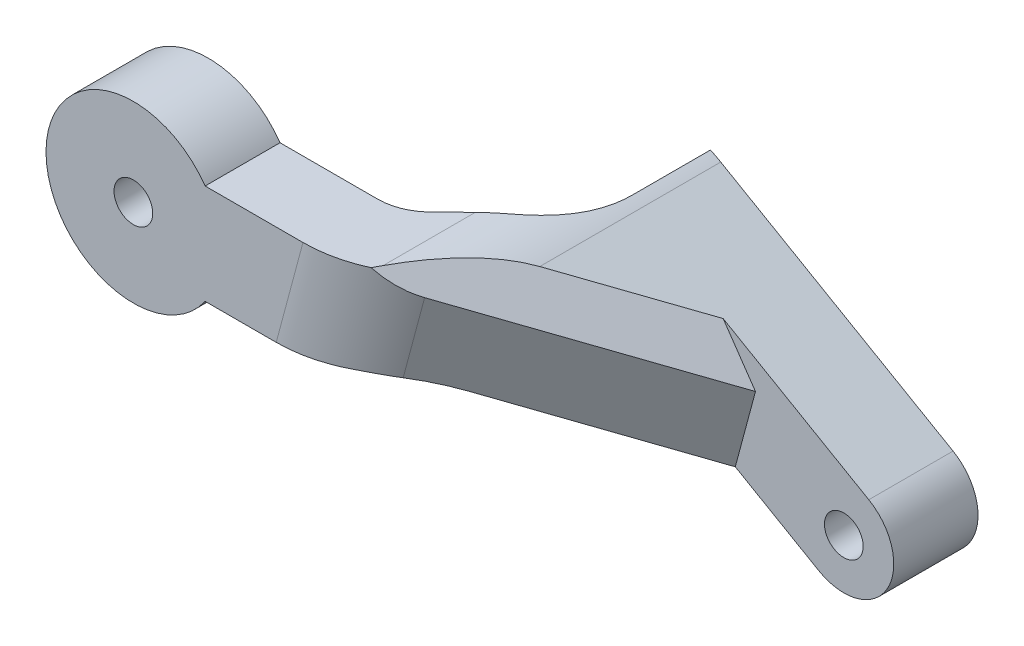
ISO-10303-21;
HEADER;
FILE_DESCRIPTION(('STEP AP214'),'2;1');
FILE_NAME('part.step','',(''),(''),'','','');
FILE_SCHEMA(('AUTOMOTIVE_DESIGN { 1 0 10303 214 1 1 1 1 }'));
ENDSEC;
DATA;
#1=APPLICATION_CONTEXT('core data for automotive mechanical design processes');
#2=APPLICATION_PROTOCOL_DEFINITION('international standard','automotive_design',2000,#1);
#3=PRODUCT_CONTEXT('',#1,'mechanical');
#4=PRODUCT('Part','Part','',(#3));
#5=PRODUCT_RELATED_PRODUCT_CATEGORY('part','',(#4));
#6=PRODUCT_DEFINITION_FORMATION('','',#4);
#7=PRODUCT_DEFINITION_CONTEXT('part definition',#1,'design');
#8=PRODUCT_DEFINITION('design','',#6,#7);
#9=PRODUCT_DEFINITION_SHAPE('','',#8);
#10=(LENGTH_UNIT() NAMED_UNIT(*) SI_UNIT(.MILLI.,.METRE.));
#11=(NAMED_UNIT(*) PLANE_ANGLE_UNIT() SI_UNIT($,.RADIAN.));
#12=(NAMED_UNIT(*) SI_UNIT($,.STERADIAN.) SOLID_ANGLE_UNIT());
#13=UNCERTAINTY_MEASURE_WITH_UNIT(LENGTH_MEASURE(1.E-05),#10,'distance_accuracy_value','');
#14=(GEOMETRIC_REPRESENTATION_CONTEXT(3) GLOBAL_UNCERTAINTY_ASSIGNED_CONTEXT((#13)) GLOBAL_UNIT_ASSIGNED_CONTEXT((#10,
#11,#12)) REPRESENTATION_CONTEXT('',''));
#15=CARTESIAN_POINT('',(0.,0.,0.));
#16=DIRECTION('',(0.,0.,1.));
#17=DIRECTION('',(1.,0.,0.));
#18=AXIS2_PLACEMENT_3D('',#15,#16,#17);
#19=CARTESIAN_POINT('',(0.,0.,-25.35));
#20=DIRECTION('',(0.,0.,-1.));
#21=DIRECTION('',(1.,0.,0.));
#22=AXIS2_PLACEMENT_3D('',#19,#20,#21);
#23=PLANE('',#22);
#24=CARTESIAN_POINT('',(40.,-11.5470053837925,-25.35));
#25=DIRECTION('',(0.,0.,-1.));
#26=DIRECTION('',(-1.,0.,0.));
#27=AXIS2_PLACEMENT_3D('',#24,#25,#26);
#28=CIRCLE('',#27,1.55);
#29=CARTESIAN_POINT('',(38.45,-11.5470053837925,-25.35));
#30=VERTEX_POINT('',#29);
#31=EDGE_CURVE('E601',#30,#30,#28,.T.);
#32=ORIENTED_EDGE('',*,*,#31,.F.);
#33=EDGE_LOOP('',(#32));
#34=FACE_BOUND('',#33,.T.);
#35=DIRECTION('',(-0.866025403784438,0.500000000000001,0.));
#36=VECTOR('',#35,1.);
#37=CARTESIAN_POINT('',(7.00000000000003,12.1243556529822,-25.35));
#38=LINE('',#37,#36);
#39=CARTESIAN_POINT('',(42.,-8.0829037686548,-25.35));
#40=VERTEX_POINT('',#39);
#41=CARTESIAN_POINT('',(23.3923048454133,2.66025403784438,-25.35));
#42=VERTEX_POINT('',#41);
#43=EDGE_CURVE('E169',#40,#42,#38,.T.);
#44=ORIENTED_EDGE('',*,*,#43,.F.);
#45=CARTESIAN_POINT('',(40.,-11.5470053837925,-25.35));
#46=DIRECTION('',(0.,0.,1.));
#47=DIRECTION('',(1.,0.,0.));
#48=AXIS2_PLACEMENT_3D('',#45,#46,#47);
#49=CIRCLE('',#48,4.);
#50=CARTESIAN_POINT('',(38.,-15.0111069989303,-25.35));
#51=VERTEX_POINT('',#50);
#52=EDGE_CURVE('E179',#40,#51,#49,.F.);
#53=ORIENTED_EDGE('',*,*,#52,.T.);
#54=DIRECTION('',(-0.866025403784438,0.500000000000001,0.));
#55=VECTOR('',#54,1.);
#56=CARTESIAN_POINT('',(3.00000000000002,5.19615242270665,-25.35));
#57=LINE('',#56,#55);
#58=CARTESIAN_POINT('',(21.2487113059643,-5.33974596215562,-25.35));
#59=VERTEX_POINT('',#58);
#60=EDGE_CURVE('E185',#51,#59,#57,.T.);
#61=ORIENTED_EDGE('',*,*,#60,.T.);
#62=CARTESIAN_POINT('',(16.2487113059643,-14.,-25.35));
#63=DIRECTION('',(0.,0.,1.));
#64=DIRECTION('',(1.,0.,0.));
#65=AXIS2_PLACEMENT_3D('',#62,#63,#64);
#66=CIRCLE('',#65,10.);
#67=CARTESIAN_POINT('',(20.4242386444629,-4.91347308123447,-25.35));
#68=VERTEX_POINT('',#67);
#69=EDGE_CURVE('E241',#68,#59,#66,.F.);
#70=ORIENTED_EDGE('',*,*,#69,.F.);
#71=DIRECTION('',(-0.258819045102521,-0.965925826289068,0.));
#72=VECTOR('',#71,1.);
#73=CARTESIAN_POINT('',(17.8819508450437,-14.4014203161296,-25.35));
#74=LINE('',#73,#72);
#75=CARTESIAN_POINT('',(22.5678321839119,3.08652691876553,-25.35));
#76=VERTEX_POINT('',#75);
#77=EDGE_CURVE('E191',#76,#68,#74,.T.);
#78=ORIENTED_EDGE('',*,*,#77,.F.);
#79=CARTESIAN_POINT('',(18.3923048454133,-6.,-25.35));
#80=DIRECTION('',(0.,0.,1.));
#81=DIRECTION('',(1.,0.,0.));
#82=AXIS2_PLACEMENT_3D('',#79,#80,#81);
#83=CIRCLE('',#82,10.);
#84=EDGE_CURVE('E190',#42,#76,#83,.T.);
#85=ORIENTED_EDGE('',*,*,#84,.F.);
#86=EDGE_LOOP('',(#44,#53,#61,#70,#78,#85));
#87=FACE_BOUND('',#86,.T.);
#88=ADVANCED_FACE('F45',(#34,#87),#23,.T.);
#89=CARTESIAN_POINT('',(40.,-11.5470053837925,-1.69999999999997));
#90=DIRECTION('',(0.,0.,-1.));
#91=DIRECTION('',(1.,0.,0.));
#92=AXIS2_PLACEMENT_3D('',#89,#90,#91);
#93=CYLINDRICAL_SURFACE('',#92,4.);
#94=DIRECTION('',(0.,0.,-1.));
#95=VECTOR('',#94,1.);
#96=CARTESIAN_POINT('',(42.,-8.0829037686548,-1.69999999999997));
#97=LINE('',#96,#95);
#98=CARTESIAN_POINT('',(42.,-8.0829037686548,-18.6));
#99=VERTEX_POINT('',#98);
#100=EDGE_CURVE('E163',#99,#40,#97,.T.);
#101=ORIENTED_EDGE('',*,*,#100,.F.);
#102=CARTESIAN_POINT('',(40.,-11.5470053837925,-18.6));
#103=DIRECTION('',(0.,0.,1.));
#104=DIRECTION('',(1.,0.,0.));
#105=AXIS2_PLACEMENT_3D('',#102,#103,#104);
#106=CIRCLE('',#105,4.);
#107=CARTESIAN_POINT('',(38.,-15.0111069989303,-18.6));
#108=VERTEX_POINT('',#107);
#109=EDGE_CURVE('E201',#99,#108,#106,.F.);
#110=ORIENTED_EDGE('',*,*,#109,.T.);
#111=DIRECTION('',(0.,0.,-1.));
#112=VECTOR('',#111,1.);
#113=CARTESIAN_POINT('',(38.,-15.0111069989303,-1.69999999999997));
#114=LINE('',#113,#112);
#115=EDGE_CURVE('E175',#108,#51,#114,.T.);
#116=ORIENTED_EDGE('',*,*,#115,.T.);
#117=ORIENTED_EDGE('',*,*,#52,.F.);
#118=EDGE_LOOP('',(#101,#110,#116,#117));
#119=FACE_BOUND('',#118,.T.);
#120=ADVANCED_FACE('F180',(#119),#93,.T.);
#121=CARTESIAN_POINT('',(7.00000000000003,12.1243556529822,-1.69999999999997));
#122=DIRECTION('',(-0.500000000000001,-0.866025403784438,0.));
#123=DIRECTION('',(0.866025403784438,-0.500000000000001,0.));
#124=AXIS2_PLACEMENT_3D('',#121,#122,#123);
#125=PLANE('',#124);
#126=DIRECTION('',(-0.622892752510496,0.359627298338203,0.694746590606866));
#127=VECTOR('',#126,1.);
#128=CARTESIAN_POINT('',(10.9496274143465,9.84403720211049,3.02151875187413));
#129=LINE('',#128,#127);
#130=CARTESIAN_POINT('',(30.3349507982985,-1.34808447194216,-18.6));
#131=VERTEX_POINT('',#130);
#132=CARTESIAN_POINT('',(23.3923048454133,2.66025403784438,-10.8564846257763));
#133=VERTEX_POINT('',#132);
#134=EDGE_CURVE('E206',#131,#133,#129,.T.);
#135=ORIENTED_EDGE('',*,*,#134,.F.);
#136=DIRECTION('',(-0.866025403784438,0.500000000000001,0.));
#137=VECTOR('',#136,1.);
#138=CARTESIAN_POINT('',(7.00000000000003,12.1243556529821,-18.6));
#139=LINE('',#138,#137);
#140=EDGE_CURVE('E171',#99,#131,#139,.T.);
#141=ORIENTED_EDGE('',*,*,#140,.F.);
#142=ORIENTED_EDGE('',*,*,#100,.T.);
#143=ORIENTED_EDGE('',*,*,#43,.T.);
#144=DIRECTION('',(0.,0.,-1.));
#145=VECTOR('',#144,1.);
#146=CARTESIAN_POINT('',(23.3923048454133,2.66025403784438,-1.69999999999997));
#147=LINE('',#146,#145);
#148=EDGE_CURVE('E223',#133,#42,#147,.T.);
#149=ORIENTED_EDGE('',*,*,#148,.F.);
#150=EDGE_LOOP('',(#135,#141,#142,#143,#149));
#151=FACE_BOUND('',#150,.T.);
#152=ADVANCED_FACE('F166',(#151),#125,.F.);
#153=CARTESIAN_POINT('',(3.00000000000002,5.19615242270665,-1.69999999999997));
#154=DIRECTION('',(-0.500000000000001,-0.866025403784438,0.));
#155=DIRECTION('',(0.866025403784438,-0.500000000000001,0.));
#156=AXIS2_PLACEMENT_3D('',#153,#154,#155);
#157=PLANE('',#156);
#158=ORIENTED_EDGE('',*,*,#60,.F.);
#159=ORIENTED_EDGE('',*,*,#115,.F.);
#160=DIRECTION('',(-0.866025403784438,0.500000000000001,0.));
#161=VECTOR('',#160,1.);
#162=CARTESIAN_POINT('',(3.00000000000002,5.19615242270664,-18.6));
#163=LINE('',#162,#161);
#164=CARTESIAN_POINT('',(31.3073117168471,-11.1470816170497,-18.6));
#165=VERTEX_POINT('',#164);
#166=EDGE_CURVE('E305',#108,#165,#163,.T.);
#167=ORIENTED_EDGE('',*,*,#166,.T.);
#168=DIRECTION('',(-0.622892752510496,0.359627298338203,0.694746590606866));
#169=VECTOR('',#168,1.);
#170=CARTESIAN_POINT('',(9.34965090661684,1.53017976251126,5.89058834626975));
#171=LINE('',#170,#169);
#172=CARTESIAN_POINT('',(21.2487113059643,-5.33974596215562,-7.38108901801699));
#173=VERTEX_POINT('',#172);
#174=EDGE_CURVE('E316',#165,#173,#171,.T.);
#175=ORIENTED_EDGE('',*,*,#174,.T.);
#176=DIRECTION('',(0.,0.,-1.));
#177=VECTOR('',#176,1.);
#178=CARTESIAN_POINT('',(21.2487113059643,-5.33974596215562,-4.79289856699177));
#179=LINE('',#178,#177);
#180=EDGE_CURVE('E220',#59,#173,#179,.F.);
#181=ORIENTED_EDGE('',*,*,#180,.F.);
#182=EDGE_LOOP('',(#158,#159,#167,#175,#181));
#183=FACE_BOUND('',#182,.T.);
#184=ADVANCED_FACE('F383',(#183),#157,.T.);
#185=CARTESIAN_POINT('',(17.8819508450437,-14.4014203161296,-14.959663415449));
#186=DIRECTION('',(0.965925826289068,-0.258819045102521,0.));
#187=DIRECTION('',(0.258819045102521,0.965925826289068,0.));
#188=AXIS2_PLACEMENT_3D('',#185,#186,#187);
#189=PLANE('',#188);
#190=DIRECTION('',(0.,0.,-1.));
#191=VECTOR('',#190,1.);
#192=CARTESIAN_POINT('',(22.5678321839119,3.08652691876553,-25.35));
#193=LINE('',#192,#191);
#194=CARTESIAN_POINT('',(22.5678321839119,3.08652691876553,-19.1017990391799));
#195=VERTEX_POINT('',#194);
#196=EDGE_CURVE('E226',#76,#195,#193,.F.);
#197=ORIENTED_EDGE('',*,*,#196,.F.);
#198=ORIENTED_EDGE('',*,*,#77,.T.);
#199=DIRECTION('',(0.,0.,1.));
#200=VECTOR('',#199,1.);
#201=CARTESIAN_POINT('',(20.4242386444629,-4.91347308123447,-14.959663415449));
#202=LINE('',#201,#200);
#203=CARTESIAN_POINT('',(20.4242386444629,-4.91347308123447,-19.1017990391799));
#204=VERTEX_POINT('',#203);
#205=EDGE_CURVE('E239',#204,#68,#202,.F.);
#206=ORIENTED_EDGE('',*,*,#205,.F.);
#207=DIRECTION('',(0.258819045102521,0.965925826289068,0.));
#208=VECTOR('',#207,1.);
#209=CARTESIAN_POINT('',(20.4242386444629,-4.91347308123447,-19.1017990391799));
#210=LINE('',#209,#208);
#211=EDGE_CURVE('E366',#195,#204,#210,.F.);
#212=ORIENTED_EDGE('',*,*,#211,.F.);
#213=EDGE_LOOP('',(#197,#198,#206,#212));
#214=FACE_BOUND('',#213,.T.);
#215=ADVANCED_FACE('F379',(#214),#189,.F.);
#216=CARTESIAN_POINT('',(0.,0.,-1.69999999999997));
#217=DIRECTION('',(0.,0.,-1.));
#218=DIRECTION('',(1.,0.,0.));
#219=AXIS2_PLACEMENT_3D('',#216,#217,#218);
#220=PLANE('',#219);
#221=DIRECTION('',(1.,0.,0.));
#222=VECTOR('',#221,1.);
#223=CARTESIAN_POINT('',(0.,4.,-1.69999999999997));
#224=LINE('',#223,#222);
#225=CARTESIAN_POINT('',(5.74456264653803,4.,-1.69999999999997));
#226=VERTEX_POINT('',#225);
#227=CARTESIAN_POINT('',(13.5815382076167,4.,-1.69999999999997));
#228=VERTEX_POINT('',#227);
#229=EDGE_CURVE('E333',#226,#228,#224,.T.);
#230=ORIENTED_EDGE('',*,*,#229,.F.);
#231=CARTESIAN_POINT('',(0.,0.,-1.69999999999997));
#232=DIRECTION('',(0.,0.,1.));
#233=DIRECTION('',(1.,0.,0.));
#234=AXIS2_PLACEMENT_3D('',#231,#232,#233);
#235=CIRCLE('',#234,7.);
#236=CARTESIAN_POINT('',(5.74456264653803,-4.,-1.69999999999997));
#237=VERTEX_POINT('',#236);
#238=EDGE_CURVE('E330',#226,#237,#235,.T.);
#239=ORIENTED_EDGE('',*,*,#238,.T.);
#240=DIRECTION('',(1.,0.,0.));
#241=VECTOR('',#240,1.);
#242=CARTESIAN_POINT('',(0.,-4.,-1.69999999999997));
#243=LINE('',#242,#241);
#244=CARTESIAN_POINT('',(11.4379446681677,-4.,-1.69999999999997));
#245=VERTEX_POINT('',#244);
#246=EDGE_CURVE('E205',#237,#245,#243,.T.);
#247=ORIENTED_EDGE('',*,*,#246,.T.);
#248=DIRECTION('',(-0.258819045102521,-0.965925826289068,0.));
#249=VECTOR('',#248,1.);
#250=CARTESIAN_POINT('',(11.6717476589409,-3.12743535947305,-1.69999999999997));
#251=LINE('',#250,#249);
#252=EDGE_CURVE('E247',#228,#245,#251,.T.);
#253=ORIENTED_EDGE('',*,*,#252,.F.);
#254=EDGE_LOOP('',(#230,#239,#247,#253));
#255=FACE_BOUND('',#254,.T.);
#256=CARTESIAN_POINT('',(0.,0.,-1.69999999999997));
#257=DIRECTION('',(0.,0.,-1.));
#258=DIRECTION('',(-1.,0.,0.));
#259=AXIS2_PLACEMENT_3D('',#256,#257,#258);
#260=CIRCLE('',#259,1.55);
#261=CARTESIAN_POINT('',(-1.55,0.,-1.69999999999997));
#262=VERTEX_POINT('',#261);
#263=EDGE_CURVE('E194',#262,#262,#260,.F.);
#264=ORIENTED_EDGE('',*,*,#263,.F.);
#265=EDGE_LOOP('',(#264));
#266=FACE_BOUND('',#265,.T.);
#267=ADVANCED_FACE('F352',(#255,#266),#220,.F.);
#268=CARTESIAN_POINT('',(0.,4.,-1.69999999999997));
#269=DIRECTION('',(0.,-1.,0.));
#270=DIRECTION('',(0.,0.,1.));
#271=AXIS2_PLACEMENT_3D('',#268,#269,#270);
#272=PLANE('',#271);
#273=DIRECTION('',(0.475576474947912,0.,-0.879674380936559));
#274=VECTOR('',#273,1.);
#275=CARTESIAN_POINT('',(14.0593147284774,4.,4.70270233877149));
#276=LINE('',#275,#274);
#277=CARTESIAN_POINT('',(18.3923048454133,4.,-3.31203472141891));
#278=VERTEX_POINT('',#277);
#279=CARTESIAN_POINT('',(18.0504129407587,4.,-2.67963685184986));
#280=VERTEX_POINT('',#279);
#281=EDGE_CURVE('E209',#278,#280,#276,.F.);
#282=ORIENTED_EDGE('',*,*,#281,.F.);
#283=DIRECTION('',(0.,0.,-1.));
#284=VECTOR('',#283,1.);
#285=CARTESIAN_POINT('',(18.3923048454133,4.,-1.69999999999997));
#286=LINE('',#285,#284);
#287=CARTESIAN_POINT('',(18.3923048454133,4.,-10.6899894902051));
#288=VERTEX_POINT('',#287);
#289=EDGE_CURVE('E231',#288,#278,#286,.F.);
#290=ORIENTED_EDGE('',*,*,#289,.F.);
#291=DIRECTION('',(0.719254596676404,0.,-0.694746590606865));
#292=VECTOR('',#291,1.);
#293=CARTESIAN_POINT('',(4.38517088009313,4.,2.83986295918837));
#294=LINE('',#293,#292);
#295=CARTESIAN_POINT('',(16.5097414378922,4.,-8.87157287525379));
#296=VERTEX_POINT('',#295);
#297=EDGE_CURVE('E301',#296,#288,#294,.T.);
#298=ORIENTED_EDGE('',*,*,#297,.F.);
#299=CARTESIAN_POINT('',(13.5815382076167,4.,-11.7));
#300=DIRECTION('',(0.,1.,0.));
#301=DIRECTION('',(-1.,0.,0.));
#302=AXIS2_PLACEMENT_3D('',#299,#300,#301);
#303=ELLIPSE('',#302,4.14110472164033,4.);
#304=CARTESIAN_POINT('',(13.5815382076167,4.,-7.69999999999998));
#305=VERTEX_POINT('',#304);
#306=EDGE_CURVE('E54',#305,#296,#303,.T.);
#307=ORIENTED_EDGE('',*,*,#306,.F.);
#308=DIRECTION('',(1.,0.,0.));
#309=VECTOR('',#308,1.);
#310=CARTESIAN_POINT('',(0.,4.,-7.69999999999998));
#311=LINE('',#310,#309);
#312=CARTESIAN_POINT('',(5.74456264653803,4.,-7.69999999999998));
#313=VERTEX_POINT('',#312);
#314=EDGE_CURVE('E320',#313,#305,#311,.T.);
#315=ORIENTED_EDGE('',*,*,#314,.F.);
#316=DIRECTION('',(0.,0.,-1.));
#317=VECTOR('',#316,1.);
#318=CARTESIAN_POINT('',(5.74456264653803,4.,-1.69999999999997));
#319=LINE('',#318,#317);
#320=EDGE_CURVE('E176',#226,#313,#319,.T.);
#321=ORIENTED_EDGE('',*,*,#320,.F.);
#322=ORIENTED_EDGE('',*,*,#229,.T.);
#323=CARTESIAN_POINT('',(13.5815382076167,4.,-11.7));
#324=DIRECTION('',(0.,1.,0.));
#325=DIRECTION('',(-1.,0.,0.));
#326=AXIS2_PLACEMENT_3D('',#323,#324,#325);
#327=ELLIPSE('',#326,10.3527618041008,10.);
#328=EDGE_CURVE('E355',#280,#228,#327,.F.);
#329=ORIENTED_EDGE('',*,*,#328,.F.);
#330=EDGE_LOOP('',(#282,#290,#298,#307,#315,#321,#322,#329));
#331=FACE_BOUND('',#330,.T.);
#332=ADVANCED_FACE('F303',(#331),#272,.F.);
#333=CARTESIAN_POINT('',(0.,0.,-1.69999999999997));
#334=DIRECTION('',(0.,0.,-1.));
#335=DIRECTION('',(1.,0.,0.));
#336=AXIS2_PLACEMENT_3D('',#333,#334,#335);
#337=CYLINDRICAL_SURFACE('',#336,7.);
#338=CARTESIAN_POINT('',(0.,0.,-7.69999999999998));
#339=DIRECTION('',(0.,0.,-1.));
#340=DIRECTION('',(-1.,0.,0.));
#341=AXIS2_PLACEMENT_3D('',#338,#339,#340);
#342=CIRCLE('',#341,7.);
#343=CARTESIAN_POINT('',(5.74456264653803,-4.,-7.69999999999998));
#344=VERTEX_POINT('',#343);
#345=EDGE_CURVE('E311',#313,#344,#342,.F.);
#346=ORIENTED_EDGE('',*,*,#345,.T.);
#347=DIRECTION('',(0.,0.,-1.));
#348=VECTOR('',#347,1.);
#349=CARTESIAN_POINT('',(5.74456264653803,-4.,-1.69999999999997));
#350=LINE('',#349,#348);
#351=EDGE_CURVE('E198',#237,#344,#350,.T.);
#352=ORIENTED_EDGE('',*,*,#351,.F.);
#353=ORIENTED_EDGE('',*,*,#238,.F.);
#354=ORIENTED_EDGE('',*,*,#320,.T.);
#355=EDGE_LOOP('',(#346,#352,#353,#354));
#356=FACE_BOUND('',#355,.T.);
#357=ADVANCED_FACE('F340',(#356),#337,.T.);
#358=CARTESIAN_POINT('',(0.,-4.,-1.69999999999997));
#359=DIRECTION('',(0.,-1.,0.));
#360=DIRECTION('',(1.,0.,0.));
#361=AXIS2_PLACEMENT_3D('',#358,#359,#360);
#362=PLANE('',#361);
#363=ORIENTED_EDGE('',*,*,#246,.F.);
#364=ORIENTED_EDGE('',*,*,#351,.T.);
#365=DIRECTION('',(1.,0.,0.));
#366=VECTOR('',#365,1.);
#367=CARTESIAN_POINT('',(0.,-4.,-7.69999999999998));
#368=LINE('',#367,#366);
#369=CARTESIAN_POINT('',(11.4379446681677,-4.,-7.69999999999998));
#370=VERTEX_POINT('',#369);
#371=EDGE_CURVE('E336',#344,#370,#368,.T.);
#372=ORIENTED_EDGE('',*,*,#371,.T.);
#373=CARTESIAN_POINT('',(11.4379446681677,-4.,-11.7));
#374=DIRECTION('',(0.,1.,0.));
#375=DIRECTION('',(-1.,0.,0.));
#376=AXIS2_PLACEMENT_3D('',#373,#374,#375);
#377=ELLIPSE('',#376,4.14110472164033,4.);
#378=CARTESIAN_POINT('',(14.3661478984432,-4.,-8.87157287525379));
#379=VERTEX_POINT('',#378);
#380=EDGE_CURVE('E11',#379,#370,#377,.F.);
#381=ORIENTED_EDGE('',*,*,#380,.F.);
#382=DIRECTION('',(0.719254596676404,0.,-0.694746590606865));
#383=VECTOR('',#382,1.);
#384=CARTESIAN_POINT('',(3.35051653041286,-4.,1.7687099560067));
#385=LINE('',#384,#383);
#386=CARTESIAN_POINT('',(16.2487113059643,-4.,-10.6899894902051));
#387=VERTEX_POINT('',#386);
#388=EDGE_CURVE('E306',#379,#387,#385,.T.);
#389=ORIENTED_EDGE('',*,*,#388,.T.);
#390=DIRECTION('',(0.,0.,-1.));
#391=VECTOR('',#390,1.);
#392=CARTESIAN_POINT('',(16.2487113059643,-4.,-13.2781799412303));
#393=LINE('',#392,#391);
#394=CARTESIAN_POINT('',(16.2487113059643,-4.,-2.84523612630837));
#395=VERTEX_POINT('',#394);
#396=EDGE_CURVE('E217',#395,#387,#393,.T.);
#397=ORIENTED_EDGE('',*,*,#396,.F.);
#398=CARTESIAN_POINT('',(11.4379446681677,-4.,-11.7));
#399=DIRECTION('',(0.,1.,0.));
#400=DIRECTION('',(-1.,0.,0.));
#401=AXIS2_PLACEMENT_3D('',#398,#399,#400);
#402=ELLIPSE('',#401,10.3527618041008,10.);
#403=EDGE_CURVE('E250',#245,#395,#402,.T.);
#404=ORIENTED_EDGE('',*,*,#403,.F.);
#405=EDGE_LOOP('',(#363,#364,#372,#381,#389,#397,#404));
#406=FACE_BOUND('',#405,.T.);
#407=ADVANCED_FACE('F347',(#406),#362,.T.);
#408=CARTESIAN_POINT('',(41.6684712197664,-20.774999241283,-18.6));
#409=DIRECTION('',(0.,0.,-1.));
#410=DIRECTION('',(1.,0.,0.));
#411=AXIS2_PLACEMENT_3D('',#408,#409,#410);
#412=PLANE('',#411);
#413=CARTESIAN_POINT('',(40.,-11.5470053837925,-18.6));
#414=DIRECTION('',(0.,0.,-1.));
#415=DIRECTION('',(-1.,0.,0.));
#416=AXIS2_PLACEMENT_3D('',#413,#414,#415);
#417=CIRCLE('',#416,1.55);
#418=CARTESIAN_POINT('',(38.45,-11.5470053837925,-18.6));
#419=VERTEX_POINT('',#418);
#420=EDGE_CURVE('E49',#419,#419,#417,.T.);
#421=ORIENTED_EDGE('',*,*,#420,.T.);
#422=EDGE_LOOP('',(#421));
#423=FACE_BOUND('',#422,.T.);
#424=ORIENTED_EDGE('',*,*,#166,.F.);
#425=ORIENTED_EDGE('',*,*,#109,.F.);
#426=ORIENTED_EDGE('',*,*,#140,.T.);
#427=DIRECTION('',(0.566606029132407,-0.823988839579035,0.));
#428=VECTOR('',#427,1.);
#429=CARTESIAN_POINT('',(43.0434718571733,-19.8294965672253,-18.6));
#430=LINE('',#429,#428);
#431=CARTESIAN_POINT('',(32.9240579011119,-5.11330271443025,-18.6));
#432=VERTEX_POINT('',#431);
#433=EDGE_CURVE('E215',#432,#131,#430,.F.);
#434=ORIENTED_EDGE('',*,*,#433,.F.);
#435=DIRECTION('',(0.258819045102521,0.965925826289068,0.));
#436=VECTOR('',#435,1.);
#437=CARTESIAN_POINT('',(29.5943983911531,-17.5397611775015,-18.6));
#438=LINE('',#437,#436);
#439=EDGE_CURVE('E210',#165,#432,#438,.T.);
#440=ORIENTED_EDGE('',*,*,#439,.F.);
#441=EDGE_LOOP('',(#424,#425,#426,#434,#440));
#442=FACE_BOUND('',#441,.T.);
#443=ADVANCED_FACE('F376',(#423,#442),#412,.F.);
#444=CARTESIAN_POINT('',(29.5943983911531,-17.5397611775015,-18.6));
#445=DIRECTION('',(-0.683012701892219,0.183012701892219,-0.707106781186548));
#446=DIRECTION('',(0.719254596676404,0.,-0.694746590606865));
#447=AXIS2_PLACEMENT_3D('',#444,#445,#446);
#448=PLANE('',#447);
#449=CARTESIAN_POINT('',(16.2487113059643,-14.,-4.79289856699177));
#450=DIRECTION('',(0.683012701892219,-0.183012701892219,0.707106781186548));
#451=DIRECTION('',(-0.683012701892219,0.18301270189222,0.707106781186547));
#452=AXIS2_PLACEMENT_3D('',#449,#450,#451);
#453=ELLIPSE('',#452,14.1421356237309,10.);
#454=CARTESIAN_POINT('',(18.6781744564636,-4.299602647295,-4.6289321881345));
#455=VERTEX_POINT('',#454);
#456=EDGE_CURVE('E244',#173,#455,#453,.T.);
#457=ORIENTED_EDGE('',*,*,#456,.F.);
#458=ORIENTED_EDGE('',*,*,#174,.F.);
#459=ORIENTED_EDGE('',*,*,#439,.T.);
#460=DIRECTION('',(0.622892752510496,-0.359627298338203,-0.694746590606866));
#461=VECTOR('',#460,1.);
#462=CARTESIAN_POINT('',(34.4158068786298,-5.97456438816355,-20.2638297877039));
#463=LINE('',#462,#461);
#464=CARTESIAN_POINT('',(20.3979411809967,2.11865414582896,-4.62893218813449));
#465=VERTEX_POINT('',#464);
#466=EDGE_CURVE('E213',#465,#432,#463,.T.);
#467=ORIENTED_EDGE('',*,*,#466,.F.);
#468=DIRECTION('',(-0.258819045102521,-0.965925826289068,0.));
#469=VECTOR('',#468,1.);
#470=CARTESIAN_POINT('',(16.0993831708363,-13.9237827473719,-4.6289321881345));
#471=LINE('',#470,#469);
#472=EDGE_CURVE('E261',#455,#465,#471,.F.);
#473=ORIENTED_EDGE('',*,*,#472,.F.);
#474=EDGE_LOOP('',(#457,#458,#459,#467,#473));
#475=FACE_BOUND('',#474,.T.);
#476=ADVANCED_FACE('F372',(#475),#448,.F.);
#477=CARTESIAN_POINT('',(17.8819508450437,-14.4014203161296,-14.959663415449));
#478=DIRECTION('',(0.683012701892219,-0.183012701892219,0.707106781186548));
#479=DIRECTION('',(-0.719254596676404,0.,0.694746590606865));
#480=AXIS2_PLACEMENT_3D('',#477,#478,#479);
#481=PLANE('',#480);
#482=ORIENTED_EDGE('',*,*,#297,.T.);
#483=CARTESIAN_POINT('',(18.3923048454133,-6.,-13.2781799412303));
#484=DIRECTION('',(-0.683012701892219,0.183012701892219,-0.707106781186548));
#485=DIRECTION('',(0.68301270189222,-0.18301270189222,-0.707106781186547));
#486=AXIS2_PLACEMENT_3D('',#483,#484,#485);
#487=ELLIPSE('',#486,14.1421356237309,10.);
#488=CARTESIAN_POINT('',(19.7553356267637,3.90667184724978,-12.0307312273144));
#489=VERTEX_POINT('',#488);
#490=EDGE_CURVE('E229',#489,#288,#487,.F.);
#491=ORIENTED_EDGE('',*,*,#490,.F.);
#492=DIRECTION('',(0.258819045102521,0.965925826289068,0.));
#493=VECTOR('',#492,1.);
#494=CARTESIAN_POINT('',(19.7387009399434,3.84459035086855,-12.0307312273144));
#495=LINE('',#494,#493);
#496=CARTESIAN_POINT('',(17.6117420873147,-4.09332815275022,-12.0307312273144));
#497=VERTEX_POINT('',#496);
#498=EDGE_CURVE('E356',#497,#489,#495,.T.);
#499=ORIENTED_EDGE('',*,*,#498,.F.);
#500=CARTESIAN_POINT('',(16.2487113059643,-14.,-13.2781799412303));
#501=DIRECTION('',(-0.683012701892219,0.183012701892219,-0.707106781186548));
#502=DIRECTION('',(-0.68301270189222,0.18301270189222,0.707106781186547));
#503=AXIS2_PLACEMENT_3D('',#500,#501,#502);
#504=ELLIPSE('',#503,14.1421356237309,10.);
#505=EDGE_CURVE('E236',#387,#497,#504,.T.);
#506=ORIENTED_EDGE('',*,*,#505,.F.);
#507=ORIENTED_EDGE('',*,*,#388,.F.);
#508=DIRECTION('',(0.258819045102521,0.965925826289068,0.));
#509=VECTOR('',#508,1.);
#510=CARTESIAN_POINT('',(14.2848989046658,-4.30322537284121,-8.87157287525379));
#511=LINE('',#510,#509);
#512=EDGE_CURVE('E60',#296,#379,#511,.F.);
#513=ORIENTED_EDGE('',*,*,#512,.F.);
#514=EDGE_LOOP('',(#482,#491,#499,#506,#507,#513));
#515=FACE_BOUND('',#514,.T.);
#516=ADVANCED_FACE('F365',(#515),#481,.F.);
#517=CARTESIAN_POINT('',(-9.16397229105025,-7.154487053259,-7.69999999999998));
#518=DIRECTION('',(0.,0.,1.));
#519=DIRECTION('',(-1.,0.,0.));
#520=AXIS2_PLACEMENT_3D('',#517,#518,#519);
#521=PLANE('',#520);
#522=ORIENTED_EDGE('',*,*,#371,.F.);
#523=ORIENTED_EDGE('',*,*,#345,.F.);
#524=ORIENTED_EDGE('',*,*,#314,.T.);
#525=DIRECTION('',(0.258819045102521,0.965925826289068,0.));
#526=VECTOR('',#525,1.);
#527=CARTESIAN_POINT('',(13.6964416365459,4.42882543472767,-7.69999999999998));
#528=LINE('',#527,#526);
#529=EDGE_CURVE('E292',#370,#305,#528,.T.);
#530=ORIENTED_EDGE('',*,*,#529,.F.);
#531=EDGE_LOOP('',(#522,#523,#524,#530));
#532=FACE_BOUND('',#531,.T.);
#533=CARTESIAN_POINT('',(0.,0.,-7.69999999999998));
#534=DIRECTION('',(0.,0.,-1.));
#535=DIRECTION('',(-1.,0.,0.));
#536=AXIS2_PLACEMENT_3D('',#533,#534,#535);
#537=CIRCLE('',#536,1.55);
#538=CARTESIAN_POINT('',(-1.55,0.,-7.69999999999998));
#539=VERTEX_POINT('',#538);
#540=EDGE_CURVE('E603',#539,#539,#537,.T.);
#541=ORIENTED_EDGE('',*,*,#540,.F.);
#542=EDGE_LOOP('',(#541));
#543=FACE_BOUND('',#542,.T.);
#544=ADVANCED_FACE('F343',(#532,#543),#521,.F.);
#545=CARTESIAN_POINT('',(10.9496274143465,9.84403720211049,3.02151875187413));
#546=DIRECTION('',(-0.752683386898187,-0.51757369100071,-0.406921606051309));
#547=DIRECTION('',(-0.622892752510496,0.359627298338203,0.694746590606866));
#548=AXIS2_PLACEMENT_3D('',#545,#546,#547);
#549=PLANE('',#548);
#550=ORIENTED_EDGE('',*,*,#466,.T.);
#551=ORIENTED_EDGE('',*,*,#433,.T.);
#552=ORIENTED_EDGE('',*,*,#134,.T.);
#553=CARTESIAN_POINT('',(18.3923048454133,-6.,9.40721349012603));
#554=DIRECTION('',(0.752683386898187,0.51757369100071,0.406921606051309));
#555=DIRECTION('',(0.335298861969855,0.230564235372914,-0.913463084381971));
#556=AXIS2_PLACEMENT_3D('',#553,#554,#555);
#557=ELLIPSE('',#556,24.5747580155257,10.);
#558=EDGE_CURVE('E234',#278,#133,#557,.F.);
#559=ORIENTED_EDGE('',*,*,#558,.F.);
#560=ORIENTED_EDGE('',*,*,#281,.T.);
#561=CARTESIAN_POINT('',(16.2020509379953,13.779886651654,-11.7));
#562=DIRECTION('',(0.752683386898187,0.51757369100071,0.406921606051309));
#563=DIRECTION('',(0.36719288687458,-0.843016189094041,0.393056088559983));
#564=AXIS2_PLACEMENT_3D('',#561,#562,#563);
#565=ELLIPSE('',#564,14.3937374219641,10.);
#566=EDGE_CURVE('E357',#465,#280,#565,.F.);
#567=ORIENTED_EDGE('',*,*,#566,.F.);
#568=EDGE_LOOP('',(#550,#551,#552,#559,#560,#567));
#569=FACE_BOUND('',#568,.T.);
#570=ADVANCED_FACE('F360',(#569),#549,.F.);
#571=CARTESIAN_POINT('',(16.2487113059643,-14.,-1.69999999999997));
#572=DIRECTION('',(0.,0.,1.));
#573=DIRECTION('',(-1.,0.,0.));
#574=AXIS2_PLACEMENT_3D('',#571,#572,#573);
#575=CYLINDRICAL_SURFACE('',#574,10.);
#576=ORIENTED_EDGE('',*,*,#396,.T.);
#577=ORIENTED_EDGE('',*,*,#505,.T.);
#578=CARTESIAN_POINT('',(20.4242386444629,-4.91347308123447,-19.1017990391799));
#579=CARTESIAN_POINT('',(20.4242375380366,-4.9134772682574,-18.9616571614326));
#580=CARTESIAN_POINT('',(20.4215228311884,-4.91222449472616,-18.8215326922273));
#581=CARTESIAN_POINT('',(20.4106646705753,-4.90724486856308,-18.5415403468163));
#582=CARTESIAN_POINT('',(20.4025212982483,-4.90351805304547,-18.401672466793));
#583=CARTESIAN_POINT('',(20.3699535437872,-4.88868979970462,-17.9828803790179));
#584=CARTESIAN_POINT('',(20.3373915242565,-4.87394050024908,-17.7046667167754));
#585=CARTESIAN_POINT('',(20.2505262201708,-4.83551854422321,-17.1516951687409));
#586=CARTESIAN_POINT('',(20.1961756138991,-4.8118264718088,-16.8769461561302));
#587=CARTESIAN_POINT('',(20.065806958593,-4.7569063803341,-16.3334048900235));
#588=CARTESIAN_POINT('',(19.9897892791629,-4.72567848982378,-16.0646125350012));
#589=CARTESIAN_POINT('',(19.8161314085277,-4.6575050296224,-15.5346813893836));
#590=CARTESIAN_POINT('',(19.7184788459969,-4.62055619221675,-15.2735470749676));
#591=CARTESIAN_POINT('',(19.5016814489343,-4.54318096065859,-14.7608309649717));
#592=CARTESIAN_POINT('',(19.382533128603,-4.50275400304348,-14.5092507267234));
#593=CARTESIAN_POINT('',(19.1233440968233,-4.42112287532597,-14.018200463266));
#594=CARTESIAN_POINT('',(18.9833669075172,-4.37992138997678,-13.7786964832223));
#595=CARTESIAN_POINT('',(18.6826624881647,-4.29948069073337,-13.3128876571057));
#596=CARTESIAN_POINT('',(18.5219480055641,-4.26024029172693,-13.0865748253394));
#597=CARTESIAN_POINT('',(18.2367587097799,-4.19891047464822,-12.7211569847234));
#598=CARTESIAN_POINT('',(18.1178346751059,-4.1754355225153,-12.577926039167));
#599=CARTESIAN_POINT('',(17.8712660000288,-4.13171845895435,-12.2987496239147));
#600=CARTESIAN_POINT('',(17.7436242908452,-4.1114752684495,-12.1628017325421));
#601=CARTESIAN_POINT('',(17.6117420873147,-4.09332815275022,-12.0307312273144));
#602=B_SPLINE_CURVE_WITH_KNOTS('',3,(#578,#579,#580,#581,#582,#583,#584,#585,#586,#587,#588,
#589,#590,#591,#592,#593,#594,#595,#596,#597,#598,#599,#600,#601),.UNSPECIFIED.,.F.,.F.,(4,2,2,
2,2,2,2,2,2,2,2,4),(0.,0.420359112849762,0.840711919843921,1.68111550788948,2.52335430819415,
3.36557874215922,4.20828602826607,5.05113009268046,5.89145449437674,6.73126477847512,
7.29384073642372,7.85622845706993),.UNSPECIFIED.);
#603=EDGE_CURVE('E286',#204,#497,#602,.T.);
#604=ORIENTED_EDGE('',*,*,#603,.F.);
#605=ORIENTED_EDGE('',*,*,#205,.T.);
#606=ORIENTED_EDGE('',*,*,#69,.T.);
#607=ORIENTED_EDGE('',*,*,#180,.T.);
#608=ORIENTED_EDGE('',*,*,#456,.T.);
#609=CARTESIAN_POINT('',(16.2487113059643,-4.,-2.84523612630837));
#610=CARTESIAN_POINT('',(16.362462070774,-3.99999769162721,-2.90289271659754));
#611=CARTESIAN_POINT('',(16.4750309526795,-4.00194123066487,-2.96283084794181));
#612=CARTESIAN_POINT('',(16.6975278977693,-4.00945724089253,-3.08718378021336));
#613=CARTESIAN_POINT('',(16.8074562693338,-4.01502928615837,-3.15159805492582));
#614=CARTESIAN_POINT('',(17.1309736348382,-4.03666570551525,-3.35026074005046));
#615=CARTESIAN_POINT('',(17.340328530038,-4.05766019984123,-3.49095879854133));
#616=CARTESIAN_POINT('',(17.7456498421365,-4.11056279789412,-3.7885043658159));
#617=CARTESIAN_POINT('',(17.9416186686458,-4.14246893118558,-3.94534895526986));
#618=CARTESIAN_POINT('',(18.2253627845072,-4.19682478858833,-4.19249297308571));
#619=CARTESIAN_POINT('',(18.3186348959151,-4.2161268810556,-4.27725828709054));
#620=CARTESIAN_POINT('',(18.5013197741884,-4.25656617180184,-4.45041233150299));
#621=CARTESIAN_POINT('',(18.5907329756609,-4.27770316261494,-4.53880065167438));
#622=CARTESIAN_POINT('',(18.6781744564636,-4.299602647295,-4.6289321881345));
#623=B_SPLINE_CURVE_WITH_KNOTS('',3,(#609,#610,#611,#612,#613,#614,#615,#616,#617,#618,#619,
#620,#621,#622),.UNSPECIFIED.,.F.,.F.,(4,2,2,2,2,2,4),(0.,0.382502442465405,0.764959993820168,
1.52306670764451,2.2810365939708,2.66344332648146,3.04580687770647),.UNSPECIFIED.);
#624=EDGE_CURVE('E253',#395,#455,#623,.T.);
#625=ORIENTED_EDGE('',*,*,#624,.F.);
#626=EDGE_LOOP('',(#576,#577,#604,#605,#606,#607,#608,#625));
#627=FACE_BOUND('',#626,.T.);
#628=ADVANCED_FACE('F263',(#627),#575,.F.);
#629=CARTESIAN_POINT('',(18.3923048454133,-6.,-1.69999999999997));
#630=DIRECTION('',(0.,0.,-1.));
#631=DIRECTION('',(1.,0.,0.));
#632=AXIS2_PLACEMENT_3D('',#629,#630,#631);
#633=CYLINDRICAL_SURFACE('',#632,10.);
#634=ORIENTED_EDGE('',*,*,#558,.T.);
#635=ORIENTED_EDGE('',*,*,#148,.T.);
#636=ORIENTED_EDGE('',*,*,#84,.T.);
#637=ORIENTED_EDGE('',*,*,#196,.T.);
#638=CARTESIAN_POINT('',(19.7553356267637,3.90667184724978,-12.0307312273144));
#639=CARTESIAN_POINT('',(19.8512975634877,3.89346823246151,-12.1268382490683));
#640=CARTESIAN_POINT('',(19.9450195270624,3.87915311538863,-12.2249937957768));
#641=CARTESIAN_POINT('',(20.1278625894366,3.84867657911515,-12.4252035392744));
#642=CARTESIAN_POINT('',(20.2169842707143,3.83251539449644,-12.527257239626));
#643=CARTESIAN_POINT('',(20.4771380313626,3.78185430451078,-12.8388075775915));
#644=CARTESIAN_POINT('',(20.6411419412535,3.745150294005,-13.0538771501687));
#645=CARTESIAN_POINT('',(20.9494561000353,3.66882601069454,-13.4968475651357));
#646=CARTESIAN_POINT('',(21.093783256522,3.62920828719665,-13.7247371507601));
#647=CARTESIAN_POINT('',(21.3625797460917,3.54971802296746,-14.1919399911814));
#648=CARTESIAN_POINT('',(21.4870460875039,3.50984544478595,-14.4312549599645));
#649=CARTESIAN_POINT('',(21.71563883535,3.43239070461895,-14.9191744545554));
#650=CARTESIAN_POINT('',(21.8198042256445,3.39480425006183,-15.1677600616273));
#651=CARTESIAN_POINT('',(22.0079671375275,3.32400644026785,-15.6730701094405));
#652=CARTESIAN_POINT('',(22.0919635194586,3.29079533230943,-15.9297950091681));
#653=CARTESIAN_POINT('',(22.239586128638,3.23064352295358,-16.449383217019));
#654=CARTESIAN_POINT('',(22.3032389042558,3.20369466198102,-16.7122380406884));
#655=CARTESIAN_POINT('',(22.4102275591547,3.15749348853515,-17.2426204972218));
#656=CARTESIAN_POINT('',(22.4535716372229,3.13823807061918,-17.5101461990915));
#657=CARTESIAN_POINT('',(22.5137820412617,3.11122032191603,-17.9984024142868));
#658=CARTESIAN_POINT('',(22.5340624986714,3.10199112211869,-18.2186379746394));
#659=CARTESIAN_POINT('',(22.5610798026156,3.08962915086715,-18.6598431493353));
#660=CARTESIAN_POINT('',(22.5678328259062,3.08648909786222,-18.8808115700108));
#661=CARTESIAN_POINT('',(22.5678321839119,3.08652691876553,-19.1017990391799));
#662=B_SPLINE_CURVE_WITH_KNOTS('',3,(#638,#639,#640,#641,#642,#643,#644,#645,#646,#647,#648,
#649,#650,#651,#652,#653,#654,#655,#656,#657,#658,#659,#660,#661),.UNSPECIFIED.,.F.,.F.,(4,2,2,
2,2,2,2,2,2,2,2,4),(0.,0.409277045599385,0.818502141635671,1.63617308886989,2.45313694911893,
3.27022375419691,4.08572570598354,4.90127372717692,5.71575307234211,6.52990332162838,
7.19349826611084,7.85629917698064),.UNSPECIFIED.);
#663=EDGE_CURVE('E279',#489,#195,#662,.T.);
#664=ORIENTED_EDGE('',*,*,#663,.F.);
#665=ORIENTED_EDGE('',*,*,#490,.T.);
#666=ORIENTED_EDGE('',*,*,#289,.T.);
#667=EDGE_LOOP('',(#634,#635,#636,#637,#664,#665,#666));
#668=FACE_BOUND('',#667,.T.);
#669=ADVANCED_FACE('F271',(#668),#633,.T.);
#670=CARTESIAN_POINT('',(11.6717476589409,-3.12743535947305,-11.7));
#671=DIRECTION('',(-0.258819045102521,-0.965925826289068,0.));
#672=DIRECTION('',(0.965925826289068,-0.258819045102521,0.));
#673=AXIS2_PLACEMENT_3D('',#670,#671,#672);
#674=CYLINDRICAL_SURFACE('',#673,10.);
#675=ORIENTED_EDGE('',*,*,#566,.T.);
#676=ORIENTED_EDGE('',*,*,#328,.T.);
#677=ORIENTED_EDGE('',*,*,#252,.T.);
#678=ORIENTED_EDGE('',*,*,#403,.T.);
#679=ORIENTED_EDGE('',*,*,#624,.T.);
#680=ORIENTED_EDGE('',*,*,#472,.T.);
#681=EDGE_LOOP('',(#675,#676,#677,#678,#679,#680));
#682=FACE_BOUND('',#681,.T.);
#683=ADVANCED_FACE('F267',(#682),#674,.T.);
#684=CARTESIAN_POINT('',(8.22269258215297,-11.8132298651044,-19.1017990391799));
#685=DIRECTION('',(-0.258819045102521,-0.965925826289068,0.));
#686=DIRECTION('',(0.965925826289068,-0.258819045102521,0.));
#687=AXIS2_PLACEMENT_3D('',#684,#685,#686);
#688=CYLINDRICAL_SURFACE('',#687,10.);
#689=ORIENTED_EDGE('',*,*,#603,.T.);
#690=ORIENTED_EDGE('',*,*,#498,.T.);
#691=ORIENTED_EDGE('',*,*,#663,.T.);
#692=ORIENTED_EDGE('',*,*,#211,.T.);
#693=EDGE_LOOP('',(#689,#690,#691,#692));
#694=FACE_BOUND('',#693,.T.);
#695=ADVANCED_FACE('F270',(#694),#688,.F.);
#696=CARTESIAN_POINT('',(9.26925615191407,-12.0936557284497,-11.7));
#697=DIRECTION('',(-0.258819045102521,-0.965925826289068,0.));
#698=DIRECTION('',(0.965925826289068,-0.258819045102521,0.));
#699=AXIS2_PLACEMENT_3D('',#696,#697,#698);
#700=CYLINDRICAL_SURFACE('',#699,4.);
#701=ORIENTED_EDGE('',*,*,#380,.T.);
#702=ORIENTED_EDGE('',*,*,#529,.T.);
#703=ORIENTED_EDGE('',*,*,#306,.T.);
#704=ORIENTED_EDGE('',*,*,#512,.T.);
#705=EDGE_LOOP('',(#701,#702,#703,#704));
#706=FACE_BOUND('',#705,.T.);
#707=ADVANCED_FACE('F47',(#706),#700,.F.);
#708=CARTESIAN_POINT('',(0.,0.,4.09827560572971));
#709=DIRECTION('',(0.,0.,-1.));
#710=DIRECTION('',(-1.,0.,0.));
#711=AXIS2_PLACEMENT_3D('',#708,#709,#710);
#712=CYLINDRICAL_SURFACE('',#711,1.55);
#713=ORIENTED_EDGE('',*,*,#263,.T.);
#714=EDGE_LOOP('',(#713));
#715=FACE_BOUND('',#714,.T.);
#716=ORIENTED_EDGE('',*,*,#540,.T.);
#717=EDGE_LOOP('',(#716));
#718=FACE_BOUND('',#717,.T.);
#719=ADVANCED_FACE('F504',(#715,#718),#712,.F.);
#720=CARTESIAN_POINT('',(40.,-11.5470053837925,-1.69999999999997));
#721=DIRECTION('',(0.,0.,-1.));
#722=DIRECTION('',(-1.,0.,0.));
#723=AXIS2_PLACEMENT_3D('',#720,#721,#722);
#724=CYLINDRICAL_SURFACE('',#723,1.55);
#725=ORIENTED_EDGE('',*,*,#31,.T.);
#726=EDGE_LOOP('',(#725));
#727=FACE_BOUND('',#726,.T.);
#728=ORIENTED_EDGE('',*,*,#420,.F.);
#729=EDGE_LOOP('',(#728));
#730=FACE_BOUND('',#729,.T.);
#731=ADVANCED_FACE('F537',(#727,#730),#724,.F.);
#732=CLOSED_SHELL('',(#88,#120,#152,#184,#215,#267,#332,#357,#407,#443,#476,#516,#544,#570,#628,
#669,#683,#695,#707,#719,#731));
#733=MANIFOLD_SOLID_BREP('B2',#732);
#734=ADVANCED_BREP_SHAPE_REPRESENTATION('',(#18,#733),#14);
#735=SHAPE_DEFINITION_REPRESENTATION(#9,#734);
ENDSEC;
END-ISO-10303-21;
